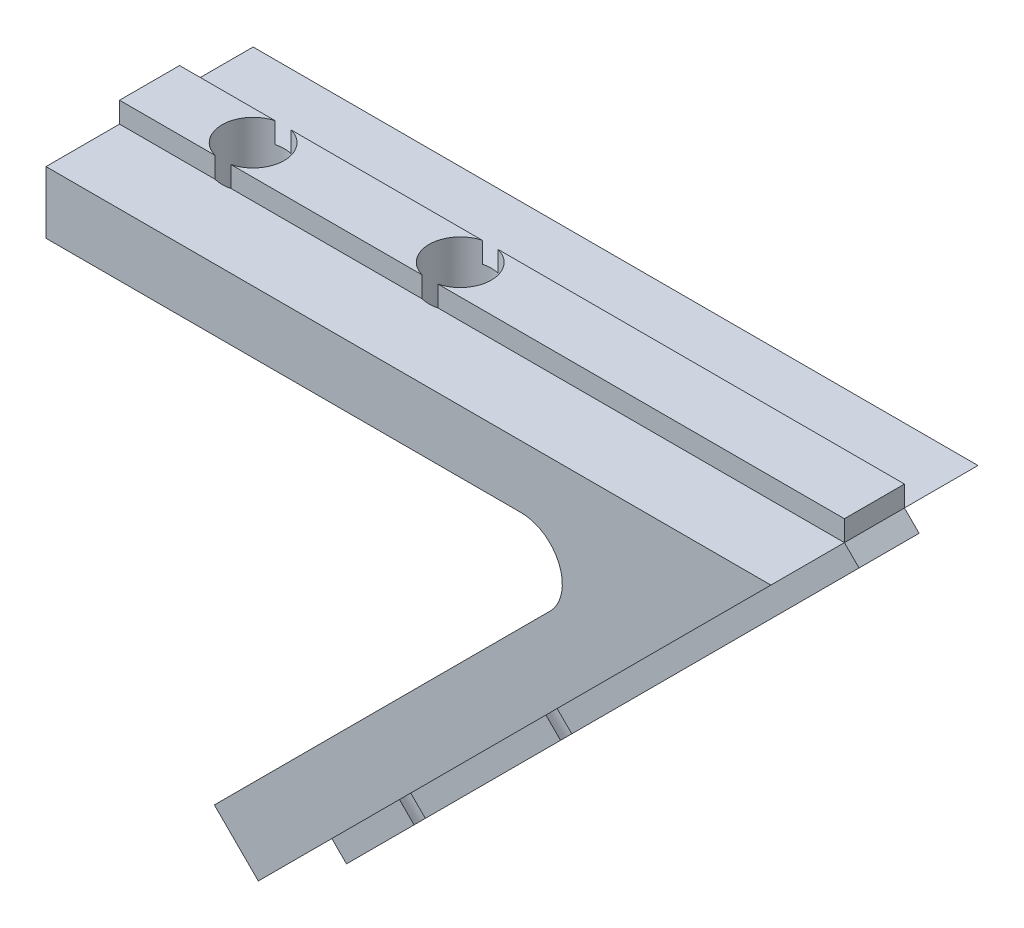
ISO-10303-21;
HEADER;
FILE_DESCRIPTION(('STEP AP214'),'2;1');
FILE_NAME('part.step','',(''),(''),'','','');
FILE_SCHEMA(('AUTOMOTIVE_DESIGN { 1 0 10303 214 1 1 1 1 }'));
ENDSEC;
DATA;
#1=APPLICATION_CONTEXT('core data for automotive mechanical design processes');
#2=APPLICATION_PROTOCOL_DEFINITION('international standard','automotive_design',2000,#1);
#3=PRODUCT_CONTEXT('',#1,'mechanical');
#4=PRODUCT('Part','Part','',(#3));
#5=PRODUCT_RELATED_PRODUCT_CATEGORY('part','',(#4));
#6=PRODUCT_DEFINITION_FORMATION('','',#4);
#7=PRODUCT_DEFINITION_CONTEXT('part definition',#1,'design');
#8=PRODUCT_DEFINITION('design','',#6,#7);
#9=PRODUCT_DEFINITION_SHAPE('','',#8);
#10=(LENGTH_UNIT() NAMED_UNIT(*) SI_UNIT(.MILLI.,.METRE.));
#11=(NAMED_UNIT(*) PLANE_ANGLE_UNIT() SI_UNIT($,.RADIAN.));
#12=(NAMED_UNIT(*) SI_UNIT($,.STERADIAN.) SOLID_ANGLE_UNIT());
#13=UNCERTAINTY_MEASURE_WITH_UNIT(LENGTH_MEASURE(1.E-05),#10,'distance_accuracy_value','');
#14=(GEOMETRIC_REPRESENTATION_CONTEXT(3) GLOBAL_UNCERTAINTY_ASSIGNED_CONTEXT((#13)) GLOBAL_UNIT_ASSIGNED_CONTEXT((#10,
#11,#12)) REPRESENTATION_CONTEXT('',''));
#15=CARTESIAN_POINT('',(0.,0.,0.));
#16=DIRECTION('',(0.,0.,1.));
#17=DIRECTION('',(1.,0.,0.));
#18=AXIS2_PLACEMENT_3D('',#15,#16,#17);
#19=CARTESIAN_POINT('',(10.9583694396573,-25.4558441227156,3.55));
#20=DIRECTION('',(0.,0.,1.));
#21=DIRECTION('',(1.,0.,0.));
#22=AXIS2_PLACEMENT_3D('',#19,#20,#21);
#23=PLANE('',#22);
#24=DIRECTION('',(0.707106781186551,0.707106781186544,0.));
#25=VECTOR('',#24,1.);
#26=CARTESIAN_POINT('',(10.9583694396573,-25.4558441227156,3.55));
#27=LINE('',#26,#25);
#28=CARTESIAN_POINT('',(21.8365406697355,-14.5776728926374,3.55));
#29=VERTEX_POINT('',#28);
#30=CARTESIAN_POINT('',(35.7071067811865,-0.707106781186558,3.55));
#31=VERTEX_POINT('',#30);
#32=EDGE_CURVE('E253',#29,#31,#27,.T.);
#33=ORIENTED_EDGE('',*,*,#32,.F.);
#34=DIRECTION('',(-0.707106781186544,0.707106781186551,0.));
#35=VECTOR('',#34,1.);
#36=CARTESIAN_POINT('',(34.2109093405001,-26.9520415634021,3.55));
#37=LINE('',#36,#35);
#38=CARTESIAN_POINT('',(21.129433888549,-13.8705661114509,3.55));
#39=VERTEX_POINT('',#38);
#40=EDGE_CURVE('E798',#29,#39,#37,.T.);
#41=ORIENTED_EDGE('',*,*,#40,.T.);
#42=DIRECTION('',(0.707106781186551,0.707106781186544,0.));
#43=VECTOR('',#42,1.);
#44=CARTESIAN_POINT('',(10.2512626584707,-24.748737341529,3.55));
#45=LINE('',#44,#43);
#46=CARTESIAN_POINT('',(35.,0.,3.55));
#47=VERTEX_POINT('',#46);
#48=EDGE_CURVE('E264',#39,#47,#45,.T.);
#49=ORIENTED_EDGE('',*,*,#48,.T.);
#50=DIRECTION('',(-0.707106781186544,0.707106781186551,0.));
#51=VECTOR('',#50,1.);
#52=CARTESIAN_POINT('',(35.7071067811865,-0.707106781186558,3.55));
#53=LINE('',#52,#51);
#54=EDGE_CURVE('E314',#31,#47,#53,.T.);
#55=ORIENTED_EDGE('',*,*,#54,.F.);
#56=EDGE_LOOP('',(#33,#41,#49,#55));
#57=FACE_BOUND('',#56,.T.);
#58=ADVANCED_FACE('F32',(#57),#23,.F.);
#59=CARTESIAN_POINT('',(18.2071067811864,-18.2071067811866,0.));
#60=DIRECTION('',(-0.707106781186544,0.707106781186551,0.));
#61=DIRECTION('',(-0.707106781186551,-0.707106781186544,0.));
#62=AXIS2_PLACEMENT_3D('',#59,#60,#61);
#63=PLANE('',#62);
#64=DIRECTION('',(-0.707106781186551,-0.707106781186544,0.));
#65=VECTOR('',#64,1.);
#66=CARTESIAN_POINT('',(10.9583694396573,-25.4558441227156,6.45));
#67=LINE('',#66,#65);
#68=CARTESIAN_POINT('',(35.7071067811865,-0.707106781186558,6.45000000000001));
#69=VERTEX_POINT('',#68);
#70=CARTESIAN_POINT('',(21.8365406697355,-14.5776728926374,6.45));
#71=VERTEX_POINT('',#70);
#72=EDGE_CURVE('E294',#69,#71,#67,.T.);
#73=ORIENTED_EDGE('',*,*,#72,.T.);
#74=CARTESIAN_POINT('',(21.5649711574555,-14.8492424049174,5.));
#75=DIRECTION('',(-0.707106781186544,0.707106781186551,0.));
#76=DIRECTION('',(-0.707106781186551,-0.707106781186544,0.));
#77=AXIS2_PLACEMENT_3D('',#74,#75,#76);
#78=CIRCLE('',#77,1.5);
#79=EDGE_CURVE('E47',#71,#29,#78,.T.);
#80=ORIENTED_EDGE('',*,*,#79,.T.);
#81=ORIENTED_EDGE('',*,*,#32,.T.);
#82=DIRECTION('',(0.,0.,1.));
#83=VECTOR('',#82,1.);
#84=CARTESIAN_POINT('',(35.7071067811865,-0.707106781186558,3.55));
#85=LINE('',#84,#83);
#86=EDGE_CURVE('E291',#31,#69,#85,.T.);
#87=ORIENTED_EDGE('',*,*,#86,.T.);
#88=EDGE_LOOP('',(#73,#80,#81,#87));
#89=FACE_BOUND('',#88,.T.);
#90=ADVANCED_FACE('F438',(#89),#63,.F.);
#91=CARTESIAN_POINT('',(10.9583694396573,-25.4558441227156,6.45));
#92=DIRECTION('',(0.,0.,-1.));
#93=DIRECTION('',(-1.,0.,0.));
#94=AXIS2_PLACEMENT_3D('',#91,#92,#93);
#95=PLANE('',#94);
#96=CARTESIAN_POINT('',(21.2934016451755,-15.1208119171974,6.45));
#97=VERTEX_POINT('',#96);
#98=CARTESIAN_POINT('',(14.76547285787,-21.6487407045029,6.45));
#99=VERTEX_POINT('',#98);
#100=EDGE_CURVE('E296',#97,#99,#67,.T.);
#101=ORIENTED_EDGE('',*,*,#100,.F.);
#102=DIRECTION('',(-0.707106781186544,0.707106781186551,0.));
#103=VECTOR('',#102,1.);
#104=CARTESIAN_POINT('',(33.66777031594,-27.4951805879621,6.45));
#105=LINE('',#104,#103);
#106=CARTESIAN_POINT('',(20.586294863989,-14.4137051360109,6.45));
#107=VERTEX_POINT('',#106);
#108=EDGE_CURVE('E11',#97,#107,#105,.T.);
#109=ORIENTED_EDGE('',*,*,#108,.T.);
#110=DIRECTION('',(-0.707106781186551,-0.707106781186544,0.));
#111=VECTOR('',#110,1.);
#112=CARTESIAN_POINT('',(10.2512626584707,-24.748737341529,6.45));
#113=LINE('',#112,#111);
#114=CARTESIAN_POINT('',(14.0583660766835,-20.9416339233163,6.45));
#115=VERTEX_POINT('',#114);
#116=EDGE_CURVE('E242',#107,#115,#113,.T.);
#117=ORIENTED_EDGE('',*,*,#116,.T.);
#118=DIRECTION('',(-0.707106781186544,0.707106781186551,0.));
#119=VECTOR('',#118,1.);
#120=CARTESIAN_POINT('',(27.1398415286345,-34.0231093752675,6.45));
#121=LINE('',#120,#119);
#122=EDGE_CURVE('E489',#115,#99,#121,.F.);
#123=ORIENTED_EDGE('',*,*,#122,.T.);
#124=EDGE_LOOP('',(#101,#109,#117,#123));
#125=FACE_BOUND('',#124,.T.);
#126=ADVANCED_FACE('F583',(#125),#95,.F.);
#127=CARTESIAN_POINT('',(14.0583660766835,-20.9416339233163,3.55));
#128=VERTEX_POINT('',#127);
#129=CARTESIAN_POINT('',(20.586294863989,-14.4137051360109,3.55));
#130=VERTEX_POINT('',#129);
#131=EDGE_CURVE('E263',#128,#130,#45,.T.);
#132=ORIENTED_EDGE('',*,*,#131,.T.);
#133=DIRECTION('',(-0.707106781186544,0.707106781186551,0.));
#134=VECTOR('',#133,1.);
#135=CARTESIAN_POINT('',(33.66777031594,-27.4951805879621,3.55));
#136=LINE('',#135,#134);
#137=CARTESIAN_POINT('',(21.2934016451755,-15.1208119171975,3.55));
#138=VERTEX_POINT('',#137);
#139=EDGE_CURVE('E436',#130,#138,#136,.F.);
#140=ORIENTED_EDGE('',*,*,#139,.T.);
#141=CARTESIAN_POINT('',(14.76547285787,-21.6487407045029,3.55));
#142=VERTEX_POINT('',#141);
#143=EDGE_CURVE('E292',#142,#138,#27,.T.);
#144=ORIENTED_EDGE('',*,*,#143,.F.);
#145=DIRECTION('',(-0.707106781186544,0.707106781186551,0.));
#146=VECTOR('',#145,1.);
#147=CARTESIAN_POINT('',(27.1398415286346,-34.0231093752675,3.55));
#148=LINE('',#147,#146);
#149=EDGE_CURVE('E434',#142,#128,#148,.T.);
#150=ORIENTED_EDGE('',*,*,#149,.T.);
#151=EDGE_LOOP('',(#132,#140,#144,#150));
#152=FACE_BOUND('',#151,.T.);
#153=ADVANCED_FACE('F433',(#152),#23,.F.);
#154=CARTESIAN_POINT('',(14.22233383331,-22.1918797290629,6.45));
#155=VERTEX_POINT('',#154);
#156=CARTESIAN_POINT('',(10.9583694396573,-25.4558441227156,6.45));
#157=VERTEX_POINT('',#156);
#158=EDGE_CURVE('E293',#155,#157,#67,.T.);
#159=ORIENTED_EDGE('',*,*,#158,.F.);
#160=DIRECTION('',(-0.707106781186544,0.707106781186551,0.));
#161=VECTOR('',#160,1.);
#162=CARTESIAN_POINT('',(26.5967025040745,-34.5662483998275,6.45));
#163=LINE('',#162,#161);
#164=CARTESIAN_POINT('',(13.5152270521235,-21.4847729478763,6.45));
#165=VERTEX_POINT('',#164);
#166=EDGE_CURVE('E55',#155,#165,#163,.T.);
#167=ORIENTED_EDGE('',*,*,#166,.T.);
#168=CARTESIAN_POINT('',(10.2512626584707,-24.748737341529,6.45));
#169=VERTEX_POINT('',#168);
#170=EDGE_CURVE('E251',#165,#169,#113,.T.);
#171=ORIENTED_EDGE('',*,*,#170,.T.);
#172=DIRECTION('',(-0.707106781186544,0.707106781186551,0.));
#173=VECTOR('',#172,1.);
#174=CARTESIAN_POINT('',(10.9583694396573,-25.4558441227156,6.45));
#175=LINE('',#174,#173);
#176=EDGE_CURVE('E295',#157,#169,#175,.T.);
#177=ORIENTED_EDGE('',*,*,#176,.F.);
#178=EDGE_LOOP('',(#159,#167,#171,#177));
#179=FACE_BOUND('',#178,.T.);
#180=ADVANCED_FACE('F304',(#179),#95,.F.);
#181=ORIENTED_EDGE('',*,*,#143,.T.);
#182=EDGE_CURVE('E799',#138,#97,#78,.T.);
#183=ORIENTED_EDGE('',*,*,#182,.T.);
#184=ORIENTED_EDGE('',*,*,#100,.T.);
#185=CARTESIAN_POINT('',(14.49390334559,-21.9203102167829,5.));
#186=DIRECTION('',(-0.707106781186544,0.707106781186551,0.));
#187=DIRECTION('',(-0.707106781186551,-0.707106781186544,0.));
#188=AXIS2_PLACEMENT_3D('',#185,#186,#187);
#189=CIRCLE('',#188,1.5);
#190=EDGE_CURVE('E233',#99,#142,#189,.T.);
#191=ORIENTED_EDGE('',*,*,#190,.T.);
#192=EDGE_LOOP('',(#181,#183,#184,#191));
#193=FACE_BOUND('',#192,.T.);
#194=ADVANCED_FACE('F425',(#193),#63,.F.);
#195=CARTESIAN_POINT('',(0.,1.,6.45000000000001));
#196=DIRECTION('',(0.,0.,-1.));
#197=DIRECTION('',(-1.,0.,0.));
#198=AXIS2_PLACEMENT_3D('',#195,#196,#197);
#199=PLANE('',#198);
#200=DIRECTION('',(1.,0.,0.));
#201=VECTOR('',#200,1.);
#202=CARTESIAN_POINT('',(0.,1.,6.45000000000001));
#203=LINE('',#202,#201);
#204=CARTESIAN_POINT('',(15.3840572873934,1.,6.45000000000001));
#205=VERTEX_POINT('',#204);
#206=CARTESIAN_POINT('',(35.,1.,6.45000000000001));
#207=VERTEX_POINT('',#206);
#208=EDGE_CURVE('E325',#205,#207,#203,.T.);
#209=ORIENTED_EDGE('',*,*,#208,.F.);
#210=DIRECTION('',(0.,-1.,0.));
#211=VECTOR('',#210,1.);
#212=CARTESIAN_POINT('',(15.3840572873934,1.,6.45000000000001));
#213=LINE('',#212,#211);
#214=CARTESIAN_POINT('',(15.3840572873934,0.,6.45000000000001));
#215=VERTEX_POINT('',#214);
#216=EDGE_CURVE('E461',#205,#215,#213,.T.);
#217=ORIENTED_EDGE('',*,*,#216,.T.);
#218=DIRECTION('',(1.,0.,0.));
#219=VECTOR('',#218,1.);
#220=CARTESIAN_POINT('',(0.,0.,6.45000000000001));
#221=LINE('',#220,#219);
#222=CARTESIAN_POINT('',(35.,0.,6.45000000000001));
#223=VERTEX_POINT('',#222);
#224=EDGE_CURVE('E313',#215,#223,#221,.T.);
#225=ORIENTED_EDGE('',*,*,#224,.T.);
#226=DIRECTION('',(0.,-1.,0.));
#227=VECTOR('',#226,1.);
#228=CARTESIAN_POINT('',(35.,1.,6.45000000000001));
#229=LINE('',#228,#227);
#230=EDGE_CURVE('E352',#207,#223,#229,.T.);
#231=ORIENTED_EDGE('',*,*,#230,.F.);
#232=EDGE_LOOP('',(#209,#217,#225,#231));
#233=FACE_BOUND('',#232,.T.);
#234=ADVANCED_FACE('F459',(#233),#199,.F.);
#235=CARTESIAN_POINT('',(0.,1.,0.));
#236=DIRECTION('',(0.,-1.,0.));
#237=DIRECTION('',(0.,0.,-1.));
#238=AXIS2_PLACEMENT_3D('',#235,#236,#237);
#239=PLANE('',#238);
#240=DIRECTION('',(-1.,0.,0.));
#241=VECTOR('',#240,1.);
#242=CARTESIAN_POINT('',(0.,1.,3.55000000000001));
#243=LINE('',#242,#241);
#244=CARTESIAN_POINT('',(35.,1.,3.54999999999999));
#245=VERTEX_POINT('',#244);
#246=CARTESIAN_POINT('',(15.3840572873934,1.,3.55));
#247=VERTEX_POINT('',#246);
#248=EDGE_CURVE('E334',#245,#247,#243,.T.);
#249=ORIENTED_EDGE('',*,*,#248,.T.);
#250=CARTESIAN_POINT('',(15.,1.,5.));
#251=DIRECTION('',(0.,-1.,0.));
#252=DIRECTION('',(0.,0.,-1.));
#253=AXIS2_PLACEMENT_3D('',#250,#251,#252);
#254=CIRCLE('',#253,1.5);
#255=EDGE_CURVE('E455',#247,#205,#254,.T.);
#256=ORIENTED_EDGE('',*,*,#255,.T.);
#257=ORIENTED_EDGE('',*,*,#208,.T.);
#258=DIRECTION('',(0.,0.,-1.));
#259=VECTOR('',#258,1.);
#260=CARTESIAN_POINT('',(35.,1.,6.45000000000001));
#261=LINE('',#260,#259);
#262=EDGE_CURVE('E330',#207,#245,#261,.T.);
#263=ORIENTED_EDGE('',*,*,#262,.T.);
#264=EDGE_LOOP('',(#249,#256,#257,#263));
#265=FACE_BOUND('',#264,.T.);
#266=ADVANCED_FACE('F454',(#265),#239,.F.);
#267=CARTESIAN_POINT('',(0.,1.,3.55000000000001));
#268=DIRECTION('',(0.,0.,1.));
#269=DIRECTION('',(1.,0.,0.));
#270=AXIS2_PLACEMENT_3D('',#267,#268,#269);
#271=PLANE('',#270);
#272=CARTESIAN_POINT('',(14.6159427126066,1.,3.55));
#273=VERTEX_POINT('',#272);
#274=CARTESIAN_POINT('',(5.38405728739345,1.,3.55000000000001));
#275=VERTEX_POINT('',#274);
#276=EDGE_CURVE('E337',#273,#275,#243,.T.);
#277=ORIENTED_EDGE('',*,*,#276,.F.);
#278=DIRECTION('',(0.,-1.,0.));
#279=VECTOR('',#278,1.);
#280=CARTESIAN_POINT('',(14.6159427126066,1.,3.55));
#281=LINE('',#280,#279);
#282=CARTESIAN_POINT('',(14.6159427126066,0.,3.55));
#283=VERTEX_POINT('',#282);
#284=EDGE_CURVE('E417',#273,#283,#281,.T.);
#285=ORIENTED_EDGE('',*,*,#284,.T.);
#286=DIRECTION('',(-1.,0.,0.));
#287=VECTOR('',#286,1.);
#288=CARTESIAN_POINT('',(0.,0.,3.55000000000001));
#289=LINE('',#288,#287);
#290=CARTESIAN_POINT('',(5.38405728739345,0.,3.55000000000001));
#291=VERTEX_POINT('',#290);
#292=EDGE_CURVE('E346',#283,#291,#289,.T.);
#293=ORIENTED_EDGE('',*,*,#292,.T.);
#294=DIRECTION('',(0.,-1.,0.));
#295=VECTOR('',#294,1.);
#296=CARTESIAN_POINT('',(5.38405728739345,1.,3.55000000000001));
#297=LINE('',#296,#295);
#298=EDGE_CURVE('E515',#291,#275,#297,.F.);
#299=ORIENTED_EDGE('',*,*,#298,.T.);
#300=EDGE_LOOP('',(#277,#285,#293,#299));
#301=FACE_BOUND('',#300,.T.);
#302=ADVANCED_FACE('F550',(#301),#271,.F.);
#303=CARTESIAN_POINT('',(5.38405728739341,0.,6.45000000000001));
#304=VERTEX_POINT('',#303);
#305=CARTESIAN_POINT('',(14.6159427126066,0.,6.45000000000001));
#306=VERTEX_POINT('',#305);
#307=EDGE_CURVE('E316',#304,#306,#221,.T.);
#308=ORIENTED_EDGE('',*,*,#307,.T.);
#309=DIRECTION('',(0.,-1.,0.));
#310=VECTOR('',#309,1.);
#311=CARTESIAN_POINT('',(14.6159427126066,1.,6.45000000000001));
#312=LINE('',#311,#310);
#313=CARTESIAN_POINT('',(14.6159427126066,1.,6.45000000000001));
#314=VERTEX_POINT('',#313);
#315=EDGE_CURVE('E507',#306,#314,#312,.F.);
#316=ORIENTED_EDGE('',*,*,#315,.T.);
#317=CARTESIAN_POINT('',(5.38405728739341,1.,6.45000000000001));
#318=VERTEX_POINT('',#317);
#319=EDGE_CURVE('E331',#318,#314,#203,.T.);
#320=ORIENTED_EDGE('',*,*,#319,.F.);
#321=DIRECTION('',(0.,-1.,0.));
#322=VECTOR('',#321,1.);
#323=CARTESIAN_POINT('',(5.38405728739341,1.,6.45000000000001));
#324=LINE('',#323,#322);
#325=EDGE_CURVE('E270',#318,#304,#324,.T.);
#326=ORIENTED_EDGE('',*,*,#325,.T.);
#327=EDGE_LOOP('',(#308,#316,#320,#326));
#328=FACE_BOUND('',#327,.T.);
#329=ADVANCED_FACE('F546',(#328),#199,.F.);
#330=CARTESIAN_POINT('',(4.61594271260655,1.,3.55000000000001));
#331=VERTEX_POINT('',#330);
#332=CARTESIAN_POINT('',(0.,1.,3.55000000000001));
#333=VERTEX_POINT('',#332);
#334=EDGE_CURVE('E333',#331,#333,#243,.T.);
#335=ORIENTED_EDGE('',*,*,#334,.F.);
#336=DIRECTION('',(0.,-1.,0.));
#337=VECTOR('',#336,1.);
#338=CARTESIAN_POINT('',(4.61594271260655,1.,3.55000000000001));
#339=LINE('',#338,#337);
#340=CARTESIAN_POINT('',(4.61594271260655,0.,3.55000000000001));
#341=VERTEX_POINT('',#340);
#342=EDGE_CURVE('E523',#331,#341,#339,.T.);
#343=ORIENTED_EDGE('',*,*,#342,.T.);
#344=CARTESIAN_POINT('',(0.,0.,3.55));
#345=VERTEX_POINT('',#344);
#346=EDGE_CURVE('E343',#341,#345,#289,.T.);
#347=ORIENTED_EDGE('',*,*,#346,.T.);
#348=DIRECTION('',(0.,-1.,0.));
#349=VECTOR('',#348,1.);
#350=CARTESIAN_POINT('',(0.,1.,3.55000000000001));
#351=LINE('',#350,#349);
#352=EDGE_CURVE('E336',#333,#345,#351,.T.);
#353=ORIENTED_EDGE('',*,*,#352,.F.);
#354=EDGE_LOOP('',(#335,#343,#347,#353));
#355=FACE_BOUND('',#354,.T.);
#356=ADVANCED_FACE('F557',(#355),#271,.F.);
#357=ORIENTED_EDGE('',*,*,#319,.T.);
#358=EDGE_CURVE('E501',#314,#273,#254,.T.);
#359=ORIENTED_EDGE('',*,*,#358,.T.);
#360=ORIENTED_EDGE('',*,*,#276,.T.);
#361=CARTESIAN_POINT('',(5.,1.,5.));
#362=DIRECTION('',(0.,-1.,0.));
#363=DIRECTION('',(0.,0.,-1.));
#364=AXIS2_PLACEMENT_3D('',#361,#362,#363);
#365=CIRCLE('',#364,1.5);
#366=EDGE_CURVE('E512',#275,#318,#365,.T.);
#367=ORIENTED_EDGE('',*,*,#366,.T.);
#368=EDGE_LOOP('',(#357,#359,#360,#367));
#369=FACE_BOUND('',#368,.T.);
#370=ADVANCED_FACE('F543',(#369),#239,.F.);
#371=CARTESIAN_POINT('',(35.,0.,10.));
#372=DIRECTION('',(-0.707106781186544,0.707106781186551,0.));
#373=DIRECTION('',(-0.707106781186551,-0.707106781186544,0.));
#374=AXIS2_PLACEMENT_3D('',#371,#372,#373);
#375=PLANE('',#374);
#376=ORIENTED_EDGE('',*,*,#48,.F.);
#377=CARTESIAN_POINT('',(20.857864376269,-14.1421356237309,5.));
#378=DIRECTION('',(-0.707106781186544,0.707106781186551,0.));
#379=DIRECTION('',(-0.707106781186551,-0.707106781186544,0.));
#380=AXIS2_PLACEMENT_3D('',#377,#378,#379);
#381=CIRCLE('',#380,1.5);
#382=EDGE_CURVE('E801',#39,#130,#381,.T.);
#383=ORIENTED_EDGE('',*,*,#382,.T.);
#384=ORIENTED_EDGE('',*,*,#131,.F.);
#385=CARTESIAN_POINT('',(13.7867965644035,-21.2132034355963,5.));
#386=DIRECTION('',(-0.707106781186544,0.707106781186551,0.));
#387=DIRECTION('',(-0.707106781186551,-0.707106781186544,0.));
#388=AXIS2_PLACEMENT_3D('',#385,#386,#387);
#389=CIRCLE('',#388,1.5);
#390=CARTESIAN_POINT('',(13.5152270521234,-21.4847729478763,3.55));
#391=VERTEX_POINT('',#390);
#392=EDGE_CURVE('E487',#128,#391,#389,.T.);
#393=ORIENTED_EDGE('',*,*,#392,.T.);
#394=CARTESIAN_POINT('',(10.2512626584707,-24.748737341529,3.55));
#395=VERTEX_POINT('',#394);
#396=EDGE_CURVE('E257',#395,#391,#45,.T.);
#397=ORIENTED_EDGE('',*,*,#396,.F.);
#398=DIRECTION('',(0.,0.,-1.));
#399=VECTOR('',#398,1.);
#400=CARTESIAN_POINT('',(10.2512626584707,-24.748737341529,10.));
#401=LINE('',#400,#399);
#402=CARTESIAN_POINT('',(10.2512626584707,-24.748737341529,0.));
#403=VERTEX_POINT('',#402);
#404=EDGE_CURVE('E312',#395,#403,#401,.T.);
#405=ORIENTED_EDGE('',*,*,#404,.T.);
#406=DIRECTION('',(0.707106781186551,0.707106781186544,0.));
#407=VECTOR('',#406,1.);
#408=CARTESIAN_POINT('',(35.,0.,0.));
#409=LINE('',#408,#407);
#410=CARTESIAN_POINT('',(35.,0.,0.));
#411=VERTEX_POINT('',#410);
#412=EDGE_CURVE('E386',#403,#411,#409,.T.);
#413=ORIENTED_EDGE('',*,*,#412,.T.);
#414=DIRECTION('',(0.,0.,-1.));
#415=VECTOR('',#414,1.);
#416=CARTESIAN_POINT('',(35.,0.,10.));
#417=LINE('',#416,#415);
#418=EDGE_CURVE('E394',#47,#411,#417,.T.);
#419=ORIENTED_EDGE('',*,*,#418,.F.);
#420=EDGE_LOOP('',(#376,#383,#384,#393,#397,#405,#413,#419));
#421=FACE_BOUND('',#420,.T.);
#422=ADVANCED_FACE('F485',(#421),#375,.F.);
#423=ORIENTED_EDGE('',*,*,#116,.F.);
#424=CARTESIAN_POINT('',(20.857864376269,-14.1421356237309,5.));
#425=DIRECTION('',(-0.707106781186544,0.707106781186551,0.));
#426=DIRECTION('',(-0.707106781186551,-0.707106781186544,0.));
#427=AXIS2_PLACEMENT_3D('',#424,#425,#426);
#428=CIRCLE('',#427,1.5);
#429=CARTESIAN_POINT('',(21.129433888549,-13.8705661114509,6.45));
#430=VERTEX_POINT('',#429);
#431=EDGE_CURVE('E228',#107,#430,#428,.T.);
#432=ORIENTED_EDGE('',*,*,#431,.T.);
#433=EDGE_CURVE('E239',#223,#430,#113,.T.);
#434=ORIENTED_EDGE('',*,*,#433,.F.);
#435=CARTESIAN_POINT('',(35.,0.,10.));
#436=VERTEX_POINT('',#435);
#437=EDGE_CURVE('E395',#436,#223,#417,.T.);
#438=ORIENTED_EDGE('',*,*,#437,.F.);
#439=DIRECTION('',(0.707106781186551,0.707106781186544,0.));
#440=VECTOR('',#439,1.);
#441=CARTESIAN_POINT('',(35.,0.,10.));
#442=LINE('',#441,#440);
#443=CARTESIAN_POINT('',(10.2512626584707,-24.748737341529,10.));
#444=VERTEX_POINT('',#443);
#445=EDGE_CURVE('E371',#444,#436,#442,.T.);
#446=ORIENTED_EDGE('',*,*,#445,.F.);
#447=EDGE_CURVE('E397',#444,#169,#401,.T.);
#448=ORIENTED_EDGE('',*,*,#447,.T.);
#449=ORIENTED_EDGE('',*,*,#170,.F.);
#450=CARTESIAN_POINT('',(13.7867965644035,-21.2132034355963,5.));
#451=DIRECTION('',(-0.707106781186544,0.707106781186551,0.));
#452=DIRECTION('',(-0.707106781186551,-0.707106781186544,0.));
#453=AXIS2_PLACEMENT_3D('',#450,#451,#452);
#454=CIRCLE('',#453,1.5);
#455=EDGE_CURVE('E490',#165,#115,#454,.T.);
#456=ORIENTED_EDGE('',*,*,#455,.T.);
#457=EDGE_LOOP('',(#423,#432,#434,#438,#446,#448,#449,#456));
#458=FACE_BOUND('',#457,.T.);
#459=ADVANCED_FACE('F237',(#458),#375,.F.);
#460=CARTESIAN_POINT('',(0.,0.,10.));
#461=DIRECTION('',(0.,-1.,0.));
#462=DIRECTION('',(0.,0.,-1.));
#463=AXIS2_PLACEMENT_3D('',#460,#461,#462);
#464=PLANE('',#463);
#465=ORIENTED_EDGE('',*,*,#292,.F.);
#466=CARTESIAN_POINT('',(15.,0.,5.));
#467=DIRECTION('',(0.,-1.,0.));
#468=DIRECTION('',(0.,0.,-1.));
#469=AXIS2_PLACEMENT_3D('',#466,#467,#468);
#470=CIRCLE('',#469,1.5);
#471=CARTESIAN_POINT('',(15.3840572873934,0.,3.55));
#472=VERTEX_POINT('',#471);
#473=EDGE_CURVE('E500',#283,#472,#470,.T.);
#474=ORIENTED_EDGE('',*,*,#473,.T.);
#475=EDGE_CURVE('E326',#47,#472,#289,.T.);
#476=ORIENTED_EDGE('',*,*,#475,.F.);
#477=ORIENTED_EDGE('',*,*,#418,.T.);
#478=DIRECTION('',(-1.,0.,0.));
#479=VECTOR('',#478,1.);
#480=CARTESIAN_POINT('',(0.,0.,0.));
#481=LINE('',#480,#479);
#482=CARTESIAN_POINT('',(0.,0.,0.));
#483=VERTEX_POINT('',#482);
#484=EDGE_CURVE('E363',#411,#483,#481,.T.);
#485=ORIENTED_EDGE('',*,*,#484,.T.);
#486=DIRECTION('',(0.,0.,-1.));
#487=VECTOR('',#486,1.);
#488=CARTESIAN_POINT('',(0.,0.,10.));
#489=LINE('',#488,#487);
#490=EDGE_CURVE('E375',#345,#483,#489,.T.);
#491=ORIENTED_EDGE('',*,*,#490,.F.);
#492=ORIENTED_EDGE('',*,*,#346,.F.);
#493=CARTESIAN_POINT('',(5.,0.,5.));
#494=DIRECTION('',(0.,-1.,0.));
#495=DIRECTION('',(0.,0.,-1.));
#496=AXIS2_PLACEMENT_3D('',#493,#494,#495);
#497=CIRCLE('',#496,1.5);
#498=EDGE_CURVE('E520',#341,#291,#497,.T.);
#499=ORIENTED_EDGE('',*,*,#498,.T.);
#500=EDGE_LOOP('',(#465,#474,#476,#477,#485,#491,#492,#499));
#501=FACE_BOUND('',#500,.T.);
#502=ADVANCED_FACE('F554',(#501),#464,.F.);
#503=ORIENTED_EDGE('',*,*,#224,.F.);
#504=CARTESIAN_POINT('',(15.,0.,5.));
#505=DIRECTION('',(0.,-1.,0.));
#506=DIRECTION('',(0.,0.,-1.));
#507=AXIS2_PLACEMENT_3D('',#504,#505,#506);
#508=CIRCLE('',#507,1.5);
#509=EDGE_CURVE('E465',#215,#306,#508,.T.);
#510=ORIENTED_EDGE('',*,*,#509,.T.);
#511=ORIENTED_EDGE('',*,*,#307,.F.);
#512=CARTESIAN_POINT('',(5.,0.,5.));
#513=DIRECTION('',(0.,-1.,0.));
#514=DIRECTION('',(0.,0.,-1.));
#515=AXIS2_PLACEMENT_3D('',#512,#513,#514);
#516=CIRCLE('',#515,1.5);
#517=CARTESIAN_POINT('',(4.61594271260659,0.,6.45000000000001));
#518=VERTEX_POINT('',#517);
#519=EDGE_CURVE('E277',#304,#518,#516,.T.);
#520=ORIENTED_EDGE('',*,*,#519,.T.);
#521=CARTESIAN_POINT('',(0.,0.,6.45000000000001));
#522=VERTEX_POINT('',#521);
#523=EDGE_CURVE('E318',#522,#518,#221,.T.);
#524=ORIENTED_EDGE('',*,*,#523,.F.);
#525=CARTESIAN_POINT('',(0.,0.,10.));
#526=VERTEX_POINT('',#525);
#527=EDGE_CURVE('E391',#526,#522,#489,.T.);
#528=ORIENTED_EDGE('',*,*,#527,.F.);
#529=DIRECTION('',(-1.,0.,0.));
#530=VECTOR('',#529,1.);
#531=CARTESIAN_POINT('',(0.,0.,10.));
#532=LINE('',#531,#530);
#533=EDGE_CURVE('E373',#436,#526,#532,.T.);
#534=ORIENTED_EDGE('',*,*,#533,.F.);
#535=ORIENTED_EDGE('',*,*,#437,.T.);
#536=EDGE_LOOP('',(#503,#510,#511,#520,#524,#528,#534,#535));
#537=FACE_BOUND('',#536,.T.);
#538=ADVANCED_FACE('F464',(#537),#464,.F.);
#539=CARTESIAN_POINT('',(0.,0.,10.));
#540=DIRECTION('',(1.,0.,0.));
#541=DIRECTION('',(0.,1.,0.));
#542=AXIS2_PLACEMENT_3D('',#539,#540,#541);
#543=PLANE('',#542);
#544=DIRECTION('',(0.,-1.,0.));
#545=VECTOR('',#544,1.);
#546=CARTESIAN_POINT('',(0.,0.,0.));
#547=LINE('',#546,#545);
#548=CARTESIAN_POINT('',(0.,-3.,0.));
#549=VERTEX_POINT('',#548);
#550=EDGE_CURVE('E358',#483,#549,#547,.T.);
#551=ORIENTED_EDGE('',*,*,#550,.T.);
#552=DIRECTION('',(0.,0.,-1.));
#553=VECTOR('',#552,1.);
#554=CARTESIAN_POINT('',(0.,-3.,10.));
#555=LINE('',#554,#553);
#556=CARTESIAN_POINT('',(0.,-3.,10.));
#557=VERTEX_POINT('',#556);
#558=EDGE_CURVE('E408',#557,#549,#555,.T.);
#559=ORIENTED_EDGE('',*,*,#558,.F.);
#560=DIRECTION('',(0.,-1.,0.));
#561=VECTOR('',#560,1.);
#562=CARTESIAN_POINT('',(0.,0.,10.));
#563=LINE('',#562,#561);
#564=EDGE_CURVE('E359',#526,#557,#563,.T.);
#565=ORIENTED_EDGE('',*,*,#564,.F.);
#566=ORIENTED_EDGE('',*,*,#527,.T.);
#567=DIRECTION('',(0.,-1.,0.));
#568=VECTOR('',#567,1.);
#569=CARTESIAN_POINT('',(0.,1.,6.45000000000001));
#570=LINE('',#569,#568);
#571=CARTESIAN_POINT('',(0.,1.,6.45000000000001));
#572=VERTEX_POINT('',#571);
#573=EDGE_CURVE('E355',#572,#522,#570,.T.);
#574=ORIENTED_EDGE('',*,*,#573,.F.);
#575=DIRECTION('',(0.,0.,1.));
#576=VECTOR('',#575,1.);
#577=CARTESIAN_POINT('',(0.,1.,6.45000000000001));
#578=LINE('',#577,#576);
#579=EDGE_CURVE('E322',#333,#572,#578,.T.);
#580=ORIENTED_EDGE('',*,*,#579,.F.);
#581=ORIENTED_EDGE('',*,*,#352,.T.);
#582=ORIENTED_EDGE('',*,*,#490,.T.);
#583=EDGE_LOOP('',(#551,#559,#565,#566,#574,#580,#581,#582));
#584=FACE_BOUND('',#583,.T.);
#585=ADVANCED_FACE('F34',(#584),#543,.F.);
#586=CARTESIAN_POINT('',(0.,-3.,10.));
#587=DIRECTION('',(0.,1.,0.));
#588=DIRECTION('',(-1.,0.,0.));
#589=AXIS2_PLACEMENT_3D('',#586,#587,#588);
#590=PLANE('',#589);
#591=CARTESIAN_POINT('',(15.,-3.,5.));
#592=DIRECTION('',(0.,-1.,0.));
#593=DIRECTION('',(0.,0.,-1.));
#594=AXIS2_PLACEMENT_3D('',#591,#592,#593);
#595=CIRCLE('',#594,1.5);
#596=CARTESIAN_POINT('',(15.,-3.,3.5));
#597=VERTEX_POINT('',#596);
#598=EDGE_CURVE('E498',#597,#597,#595,.T.);
#599=ORIENTED_EDGE('',*,*,#598,.F.);
#600=EDGE_LOOP('',(#599));
#601=FACE_BOUND('',#600,.T.);
#602=CARTESIAN_POINT('',(5.,-3.,5.));
#603=DIRECTION('',(0.,-1.,0.));
#604=DIRECTION('',(0.,0.,-1.));
#605=AXIS2_PLACEMENT_3D('',#602,#603,#604);
#606=CIRCLE('',#605,1.5);
#607=CARTESIAN_POINT('',(5.,-3.,3.5));
#608=VERTEX_POINT('',#607);
#609=EDGE_CURVE('E511',#608,#608,#606,.T.);
#610=ORIENTED_EDGE('',*,*,#609,.F.);
#611=EDGE_LOOP('',(#610));
#612=FACE_BOUND('',#611,.T.);
#613=DIRECTION('',(1.,0.,0.));
#614=VECTOR('',#613,1.);
#615=CARTESIAN_POINT('',(0.,-3.,0.));
#616=LINE('',#615,#614);
#617=CARTESIAN_POINT('',(22.9289321881344,-3.,0.));
#618=VERTEX_POINT('',#617);
#619=EDGE_CURVE('E378',#549,#618,#616,.T.);
#620=ORIENTED_EDGE('',*,*,#619,.T.);
#621=DIRECTION('',(0.,0.,-1.));
#622=VECTOR('',#621,1.);
#623=CARTESIAN_POINT('',(22.9289321881344,-3.,10.));
#624=LINE('',#623,#622);
#625=CARTESIAN_POINT('',(22.9289321881344,-3.,10.));
#626=VERTEX_POINT('',#625);
#627=EDGE_CURVE('E405',#626,#618,#624,.T.);
#628=ORIENTED_EDGE('',*,*,#627,.F.);
#629=DIRECTION('',(1.,0.,0.));
#630=VECTOR('',#629,1.);
#631=CARTESIAN_POINT('',(0.,-3.,10.));
#632=LINE('',#631,#630);
#633=EDGE_CURVE('E362',#557,#626,#632,.T.);
#634=ORIENTED_EDGE('',*,*,#633,.F.);
#635=ORIENTED_EDGE('',*,*,#558,.T.);
#636=EDGE_LOOP('',(#620,#628,#634,#635));
#637=FACE_BOUND('',#636,.T.);
#638=ADVANCED_FACE('F560',(#601,#612,#637),#590,.F.);
#639=CARTESIAN_POINT('',(22.9289321881344,-5.,10.));
#640=DIRECTION('',(0.,0.,-1.));
#641=DIRECTION('',(-1.,0.,0.));
#642=AXIS2_PLACEMENT_3D('',#639,#640,#641);
#643=CYLINDRICAL_SURFACE('',#642,2.);
#644=CARTESIAN_POINT('',(22.9289321881344,-5.,0.));
#645=DIRECTION('',(0.,0.,-1.));
#646=DIRECTION('',(1.,0.,0.));
#647=AXIS2_PLACEMENT_3D('',#644,#645,#646);
#648=CIRCLE('',#647,2.);
#649=CARTESIAN_POINT('',(24.3431457505075,-6.4142135623731,0.));
#650=VERTEX_POINT('',#649);
#651=EDGE_CURVE('E380',#618,#650,#648,.T.);
#652=ORIENTED_EDGE('',*,*,#651,.T.);
#653=DIRECTION('',(0.,0.,-1.));
#654=VECTOR('',#653,1.);
#655=CARTESIAN_POINT('',(24.3431457505075,-6.4142135623731,10.));
#656=LINE('',#655,#654);
#657=CARTESIAN_POINT('',(24.3431457505075,-6.4142135623731,10.));
#658=VERTEX_POINT('',#657);
#659=EDGE_CURVE('E402',#658,#650,#656,.T.);
#660=ORIENTED_EDGE('',*,*,#659,.F.);
#661=CARTESIAN_POINT('',(22.9289321881344,-5.,10.));
#662=DIRECTION('',(0.,0.,-1.));
#663=DIRECTION('',(1.,0.,0.));
#664=AXIS2_PLACEMENT_3D('',#661,#662,#663);
#665=CIRCLE('',#664,2.);
#666=EDGE_CURVE('E365',#626,#658,#665,.T.);
#667=ORIENTED_EDGE('',*,*,#666,.F.);
#668=ORIENTED_EDGE('',*,*,#627,.T.);
#669=EDGE_LOOP('',(#652,#660,#667,#668));
#670=FACE_BOUND('',#669,.T.);
#671=ADVANCED_FACE('F564',(#670),#643,.F.);
#672=CARTESIAN_POINT('',(8.12994231491108,-22.6274169979694,10.));
#673=DIRECTION('',(0.707106781186544,-0.707106781186551,0.));
#674=DIRECTION('',(0.707106781186551,0.707106781186544,0.));
#675=AXIS2_PLACEMENT_3D('',#672,#673,#674);
#676=PLANE('',#675);
#677=CARTESIAN_POINT('',(18.7365440327094,-12.0208152801712,5.));
#678=DIRECTION('',(-0.707106781186544,0.707106781186551,0.));
#679=DIRECTION('',(-0.707106781186551,-0.707106781186544,0.));
#680=AXIS2_PLACEMENT_3D('',#677,#678,#679);
#681=CIRCLE('',#680,1.5);
#682=CARTESIAN_POINT('',(17.6758838609295,-13.081475451951,5.));
#683=VERTEX_POINT('',#682);
#684=EDGE_CURVE('E243',#683,#683,#681,.T.);
#685=ORIENTED_EDGE('',*,*,#684,.F.);
#686=EDGE_LOOP('',(#685));
#687=FACE_BOUND('',#686,.T.);
#688=CARTESIAN_POINT('',(11.6654762208438,-19.0918830920367,5.));
#689=DIRECTION('',(-0.707106781186544,0.707106781186551,0.));
#690=DIRECTION('',(-0.707106781186551,-0.707106781186544,0.));
#691=AXIS2_PLACEMENT_3D('',#688,#689,#690);
#692=CIRCLE('',#691,1.5);
#693=CARTESIAN_POINT('',(10.604816049064,-20.1525432638165,5.));
#694=VERTEX_POINT('',#693);
#695=EDGE_CURVE('E804',#694,#694,#692,.T.);
#696=ORIENTED_EDGE('',*,*,#695,.F.);
#697=EDGE_LOOP('',(#696));
#698=FACE_BOUND('',#697,.T.);
#699=DIRECTION('',(-0.707106781186551,-0.707106781186544,0.));
#700=VECTOR('',#699,1.);
#701=CARTESIAN_POINT('',(8.12994231491108,-22.6274169979694,0.));
#702=LINE('',#701,#700);
#703=CARTESIAN_POINT('',(8.12994231491108,-22.6274169979694,0.));
#704=VERTEX_POINT('',#703);
#705=EDGE_CURVE('E382',#650,#704,#702,.T.);
#706=ORIENTED_EDGE('',*,*,#705,.T.);
#707=DIRECTION('',(0.,0.,-1.));
#708=VECTOR('',#707,1.);
#709=CARTESIAN_POINT('',(8.12994231491108,-22.6274169979694,10.));
#710=LINE('',#709,#708);
#711=CARTESIAN_POINT('',(8.12994231491108,-22.6274169979694,10.));
#712=VERTEX_POINT('',#711);
#713=EDGE_CURVE('E399',#712,#704,#710,.T.);
#714=ORIENTED_EDGE('',*,*,#713,.F.);
#715=DIRECTION('',(-0.707106781186551,-0.707106781186544,0.));
#716=VECTOR('',#715,1.);
#717=CARTESIAN_POINT('',(8.12994231491108,-22.6274169979694,10.));
#718=LINE('',#717,#716);
#719=EDGE_CURVE('E367',#658,#712,#718,.T.);
#720=ORIENTED_EDGE('',*,*,#719,.F.);
#721=ORIENTED_EDGE('',*,*,#659,.T.);
#722=EDGE_LOOP('',(#706,#714,#720,#721));
#723=FACE_BOUND('',#722,.T.);
#724=ADVANCED_FACE('F565',(#687,#698,#723),#676,.F.);
#725=CARTESIAN_POINT('',(10.2512626584707,-24.748737341529,10.));
#726=DIRECTION('',(0.707106781186551,0.707106781186544,0.));
#727=DIRECTION('',(-0.707106781186544,0.707106781186551,0.));
#728=AXIS2_PLACEMENT_3D('',#725,#726,#727);
#729=PLANE('',#728);
#730=DIRECTION('',(0.707106781186544,-0.707106781186551,0.));
#731=VECTOR('',#730,1.);
#732=CARTESIAN_POINT('',(10.2512626584707,-24.748737341529,0.));
#733=LINE('',#732,#731);
#734=EDGE_CURVE('E384',#704,#403,#733,.T.);
#735=ORIENTED_EDGE('',*,*,#734,.T.);
#736=ORIENTED_EDGE('',*,*,#404,.F.);
#737=DIRECTION('',(-0.707106781186544,0.707106781186551,0.));
#738=VECTOR('',#737,1.);
#739=CARTESIAN_POINT('',(10.9583694396573,-25.4558441227156,3.55));
#740=LINE('',#739,#738);
#741=CARTESIAN_POINT('',(10.9583694396573,-25.4558441227156,3.55));
#742=VERTEX_POINT('',#741);
#743=EDGE_CURVE('E311',#742,#395,#740,.T.);
#744=ORIENTED_EDGE('',*,*,#743,.F.);
#745=DIRECTION('',(0.,0.,-1.));
#746=VECTOR('',#745,1.);
#747=CARTESIAN_POINT('',(10.9583694396573,-25.4558441227156,3.55));
#748=LINE('',#747,#746);
#749=EDGE_CURVE('E249',#157,#742,#748,.T.);
#750=ORIENTED_EDGE('',*,*,#749,.F.);
#751=ORIENTED_EDGE('',*,*,#176,.T.);
#752=ORIENTED_EDGE('',*,*,#447,.F.);
#753=DIRECTION('',(0.707106781186544,-0.707106781186551,0.));
#754=VECTOR('',#753,1.);
#755=CARTESIAN_POINT('',(10.2512626584707,-24.748737341529,10.));
#756=LINE('',#755,#754);
#757=EDGE_CURVE('E369',#712,#444,#756,.T.);
#758=ORIENTED_EDGE('',*,*,#757,.F.);
#759=ORIENTED_EDGE('',*,*,#713,.T.);
#760=EDGE_LOOP('',(#735,#736,#744,#750,#751,#752,#758,#759));
#761=FACE_BOUND('',#760,.T.);
#762=ADVANCED_FACE('F309',(#761),#729,.F.);
#763=CARTESIAN_POINT('',(22.9289321881344,-5.,10.));
#764=DIRECTION('',(0.,0.,1.));
#765=DIRECTION('',(1.,0.,0.));
#766=AXIS2_PLACEMENT_3D('',#763,#764,#765);
#767=PLANE('',#766);
#768=ORIENTED_EDGE('',*,*,#564,.T.);
#769=ORIENTED_EDGE('',*,*,#633,.T.);
#770=ORIENTED_EDGE('',*,*,#666,.T.);
#771=ORIENTED_EDGE('',*,*,#719,.T.);
#772=ORIENTED_EDGE('',*,*,#757,.T.);
#773=ORIENTED_EDGE('',*,*,#445,.T.);
#774=ORIENTED_EDGE('',*,*,#533,.T.);
#775=EDGE_LOOP('',(#768,#769,#770,#771,#772,#773,#774));
#776=FACE_BOUND('',#775,.T.);
#777=ADVANCED_FACE('F470',(#776),#767,.T.);
#778=CARTESIAN_POINT('',(22.9289321881344,-5.,0.));
#779=DIRECTION('',(0.,0.,1.));
#780=DIRECTION('',(1.,0.,0.));
#781=AXIS2_PLACEMENT_3D('',#778,#779,#780);
#782=PLANE('',#781);
#783=ORIENTED_EDGE('',*,*,#550,.F.);
#784=ORIENTED_EDGE('',*,*,#484,.F.);
#785=ORIENTED_EDGE('',*,*,#412,.F.);
#786=ORIENTED_EDGE('',*,*,#734,.F.);
#787=ORIENTED_EDGE('',*,*,#705,.F.);
#788=ORIENTED_EDGE('',*,*,#651,.F.);
#789=ORIENTED_EDGE('',*,*,#619,.F.);
#790=EDGE_LOOP('',(#783,#784,#785,#786,#787,#788,#789));
#791=FACE_BOUND('',#790,.T.);
#792=ADVANCED_FACE('F480',(#791),#782,.F.);
#793=ORIENTED_EDGE('',*,*,#523,.T.);
#794=DIRECTION('',(0.,-1.,0.));
#795=VECTOR('',#794,1.);
#796=CARTESIAN_POINT('',(4.61594271260659,1.,6.45000000000001));
#797=LINE('',#796,#795);
#798=CARTESIAN_POINT('',(4.61594271260659,1.,6.45000000000001));
#799=VERTEX_POINT('',#798);
#800=EDGE_CURVE('E284',#518,#799,#797,.F.);
#801=ORIENTED_EDGE('',*,*,#800,.T.);
#802=EDGE_CURVE('E327',#572,#799,#203,.T.);
#803=ORIENTED_EDGE('',*,*,#802,.F.);
#804=ORIENTED_EDGE('',*,*,#573,.T.);
#805=EDGE_LOOP('',(#793,#801,#803,#804));
#806=FACE_BOUND('',#805,.T.);
#807=ADVANCED_FACE('F527',(#806),#199,.F.);
#808=CARTESIAN_POINT('',(35.,1.,6.45000000000001));
#809=DIRECTION('',(-1.,0.,0.));
#810=DIRECTION('',(0.,0.,1.));
#811=AXIS2_PLACEMENT_3D('',#808,#809,#810);
#812=PLANE('',#811);
#813=DIRECTION('',(0.,0.,-1.));
#814=VECTOR('',#813,1.);
#815=CARTESIAN_POINT('',(35.,0.,6.45000000000001));
#816=LINE('',#815,#814);
#817=EDGE_CURVE('E340',#223,#47,#816,.T.);
#818=ORIENTED_EDGE('',*,*,#817,.T.);
#819=DIRECTION('',(0.,-1.,0.));
#820=VECTOR('',#819,1.);
#821=CARTESIAN_POINT('',(35.,1.,3.54999999999999));
#822=LINE('',#821,#820);
#823=EDGE_CURVE('E349',#245,#47,#822,.T.);
#824=ORIENTED_EDGE('',*,*,#823,.F.);
#825=ORIENTED_EDGE('',*,*,#262,.F.);
#826=ORIENTED_EDGE('',*,*,#230,.T.);
#827=EDGE_LOOP('',(#818,#824,#825,#826));
#828=FACE_BOUND('',#827,.T.);
#829=ADVANCED_FACE('F446',(#828),#812,.F.);
#830=ORIENTED_EDGE('',*,*,#475,.T.);
#831=DIRECTION('',(0.,-1.,0.));
#832=VECTOR('',#831,1.);
#833=CARTESIAN_POINT('',(15.3840572873934,1.,3.55));
#834=LINE('',#833,#832);
#835=EDGE_CURVE('E414',#472,#247,#834,.F.);
#836=ORIENTED_EDGE('',*,*,#835,.T.);
#837=ORIENTED_EDGE('',*,*,#248,.F.);
#838=ORIENTED_EDGE('',*,*,#823,.T.);
#839=EDGE_LOOP('',(#830,#836,#837,#838));
#840=FACE_BOUND('',#839,.T.);
#841=ADVANCED_FACE('F451',(#840),#271,.F.);
#842=ORIENTED_EDGE('',*,*,#802,.T.);
#843=CARTESIAN_POINT('',(5.,1.,5.));
#844=DIRECTION('',(0.,-1.,0.));
#845=DIRECTION('',(0.,0.,-1.));
#846=AXIS2_PLACEMENT_3D('',#843,#844,#845);
#847=CIRCLE('',#846,1.5);
#848=EDGE_CURVE('E411',#799,#331,#847,.T.);
#849=ORIENTED_EDGE('',*,*,#848,.T.);
#850=ORIENTED_EDGE('',*,*,#334,.T.);
#851=ORIENTED_EDGE('',*,*,#579,.T.);
#852=EDGE_LOOP('',(#842,#849,#850,#851));
#853=FACE_BOUND('',#852,.T.);
#854=ADVANCED_FACE('F530',(#853),#239,.F.);
#855=ORIENTED_EDGE('',*,*,#396,.T.);
#856=DIRECTION('',(-0.707106781186544,0.707106781186551,0.));
#857=VECTOR('',#856,1.);
#858=CARTESIAN_POINT('',(26.5967025040745,-34.5662483998275,3.55));
#859=LINE('',#858,#857);
#860=CARTESIAN_POINT('',(14.22233383331,-22.1918797290629,3.55));
#861=VERTEX_POINT('',#860);
#862=EDGE_CURVE('E493',#391,#861,#859,.F.);
#863=ORIENTED_EDGE('',*,*,#862,.T.);
#864=EDGE_CURVE('E288',#742,#861,#27,.T.);
#865=ORIENTED_EDGE('',*,*,#864,.F.);
#866=ORIENTED_EDGE('',*,*,#743,.T.);
#867=EDGE_LOOP('',(#855,#863,#865,#866));
#868=FACE_BOUND('',#867,.T.);
#869=ADVANCED_FACE('F579',(#868),#23,.F.);
#870=CARTESIAN_POINT('',(35.7071067811865,-0.707106781186558,3.55));
#871=DIRECTION('',(-0.707106781186551,-0.707106781186544,0.));
#872=DIRECTION('',(0.707106781186544,-0.707106781186551,0.));
#873=AXIS2_PLACEMENT_3D('',#870,#871,#872);
#874=PLANE('',#873);
#875=ORIENTED_EDGE('',*,*,#817,.F.);
#876=DIRECTION('',(-0.707106781186544,0.707106781186551,0.));
#877=VECTOR('',#876,1.);
#878=CARTESIAN_POINT('',(35.7071067811865,-0.707106781186558,6.45000000000001));
#879=LINE('',#878,#877);
#880=EDGE_CURVE('E248',#69,#223,#879,.T.);
#881=ORIENTED_EDGE('',*,*,#880,.F.);
#882=ORIENTED_EDGE('',*,*,#86,.F.);
#883=ORIENTED_EDGE('',*,*,#54,.T.);
#884=EDGE_LOOP('',(#875,#881,#882,#883));
#885=FACE_BOUND('',#884,.T.);
#886=ADVANCED_FACE('F443',(#885),#874,.F.);
#887=ORIENTED_EDGE('',*,*,#433,.T.);
#888=DIRECTION('',(-0.707106781186544,0.707106781186551,0.));
#889=VECTOR('',#888,1.);
#890=CARTESIAN_POINT('',(34.2109093405001,-26.9520415634021,6.45));
#891=LINE('',#890,#889);
#892=EDGE_CURVE('E40',#430,#71,#891,.F.);
#893=ORIENTED_EDGE('',*,*,#892,.T.);
#894=ORIENTED_EDGE('',*,*,#72,.F.);
#895=ORIENTED_EDGE('',*,*,#880,.T.);
#896=EDGE_LOOP('',(#887,#893,#894,#895));
#897=FACE_BOUND('',#896,.T.);
#898=ADVANCED_FACE('F246',(#897),#95,.F.);
#899=ORIENTED_EDGE('',*,*,#864,.T.);
#900=EDGE_CURVE('E303',#861,#155,#189,.T.);
#901=ORIENTED_EDGE('',*,*,#900,.T.);
#902=ORIENTED_EDGE('',*,*,#158,.T.);
#903=ORIENTED_EDGE('',*,*,#749,.T.);
#904=EDGE_LOOP('',(#899,#901,#902,#903));
#905=FACE_BOUND('',#904,.T.);
#906=ADVANCED_FACE('F300',(#905),#63,.F.);
#907=CARTESIAN_POINT('',(5.,1.,5.));
#908=DIRECTION('',(0.,-1.,0.));
#909=DIRECTION('',(0.,0.,-1.));
#910=AXIS2_PLACEMENT_3D('',#907,#908,#909);
#911=CYLINDRICAL_SURFACE('',#910,1.5);
#912=ORIENTED_EDGE('',*,*,#609,.T.);
#913=EDGE_LOOP('',(#912));
#914=FACE_BOUND('',#913,.T.);
#915=ORIENTED_EDGE('',*,*,#366,.F.);
#916=ORIENTED_EDGE('',*,*,#298,.F.);
#917=ORIENTED_EDGE('',*,*,#498,.F.);
#918=ORIENTED_EDGE('',*,*,#342,.F.);
#919=ORIENTED_EDGE('',*,*,#848,.F.);
#920=ORIENTED_EDGE('',*,*,#800,.F.);
#921=ORIENTED_EDGE('',*,*,#519,.F.);
#922=ORIENTED_EDGE('',*,*,#325,.F.);
#923=EDGE_LOOP('',(#915,#916,#917,#918,#919,#920,#921,#922));
#924=FACE_BOUND('',#923,.T.);
#925=ADVANCED_FACE('F539',(#914,#924),#911,.F.);
#926=CARTESIAN_POINT('',(15.,1.,5.));
#927=DIRECTION('',(0.,-1.,0.));
#928=DIRECTION('',(0.,0.,-1.));
#929=AXIS2_PLACEMENT_3D('',#926,#927,#928);
#930=CYLINDRICAL_SURFACE('',#929,1.5);
#931=ORIENTED_EDGE('',*,*,#598,.T.);
#932=EDGE_LOOP('',(#931));
#933=FACE_BOUND('',#932,.T.);
#934=ORIENTED_EDGE('',*,*,#255,.F.);
#935=ORIENTED_EDGE('',*,*,#835,.F.);
#936=ORIENTED_EDGE('',*,*,#473,.F.);
#937=ORIENTED_EDGE('',*,*,#284,.F.);
#938=ORIENTED_EDGE('',*,*,#358,.F.);
#939=ORIENTED_EDGE('',*,*,#315,.F.);
#940=ORIENTED_EDGE('',*,*,#509,.F.);
#941=ORIENTED_EDGE('',*,*,#216,.F.);
#942=EDGE_LOOP('',(#934,#935,#936,#937,#938,#939,#940,#941));
#943=FACE_BOUND('',#942,.T.);
#944=ADVANCED_FACE('F548',(#933,#943),#930,.F.);
#945=CARTESIAN_POINT('',(26.8682720163545,-34.2946788875475,5.));
#946=DIRECTION('',(-0.707106781186544,0.707106781186551,0.));
#947=DIRECTION('',(-0.707106781186551,-0.707106781186544,0.));
#948=AXIS2_PLACEMENT_3D('',#945,#946,#947);
#949=CYLINDRICAL_SURFACE('',#948,1.5);
#950=ORIENTED_EDGE('',*,*,#695,.T.);
#951=EDGE_LOOP('',(#950));
#952=FACE_BOUND('',#951,.T.);
#953=ORIENTED_EDGE('',*,*,#122,.F.);
#954=ORIENTED_EDGE('',*,*,#455,.F.);
#955=ORIENTED_EDGE('',*,*,#166,.F.);
#956=ORIENTED_EDGE('',*,*,#900,.F.);
#957=ORIENTED_EDGE('',*,*,#862,.F.);
#958=ORIENTED_EDGE('',*,*,#392,.F.);
#959=ORIENTED_EDGE('',*,*,#149,.F.);
#960=ORIENTED_EDGE('',*,*,#190,.F.);
#961=EDGE_LOOP('',(#953,#954,#955,#956,#957,#958,#959,#960));
#962=FACE_BOUND('',#961,.T.);
#963=ADVANCED_FACE('F697',(#952,#962),#949,.F.);
#964=CARTESIAN_POINT('',(33.93933982822,-27.2236110756821,5.));
#965=DIRECTION('',(-0.707106781186544,0.707106781186551,0.));
#966=DIRECTION('',(-0.707106781186551,-0.707106781186544,0.));
#967=AXIS2_PLACEMENT_3D('',#964,#965,#966);
#968=CYLINDRICAL_SURFACE('',#967,1.5);
#969=ORIENTED_EDGE('',*,*,#684,.T.);
#970=EDGE_LOOP('',(#969));
#971=FACE_BOUND('',#970,.T.);
#972=ORIENTED_EDGE('',*,*,#382,.F.);
#973=ORIENTED_EDGE('',*,*,#40,.F.);
#974=ORIENTED_EDGE('',*,*,#79,.F.);
#975=ORIENTED_EDGE('',*,*,#892,.F.);
#976=ORIENTED_EDGE('',*,*,#431,.F.);
#977=ORIENTED_EDGE('',*,*,#108,.F.);
#978=ORIENTED_EDGE('',*,*,#182,.F.);
#979=ORIENTED_EDGE('',*,*,#139,.F.);
#980=EDGE_LOOP('',(#972,#973,#974,#975,#976,#977,#978,#979));
#981=FACE_BOUND('',#980,.T.);
#982=ADVANCED_FACE('F227',(#971,#981),#968,.F.);
#983=CLOSED_SHELL('',(#58,#90,#126,#153,#180,#194,#234,#266,#302,#329,#356,#370,#422,#459,#502,
#538,#585,#638,#671,#724,#762,#777,#792,#807,#829,#841,#854,#869,#886,#898,#906,#925,#944,#963,#982));
#984=MANIFOLD_SOLID_BREP('B2',#983);
#985=ADVANCED_BREP_SHAPE_REPRESENTATION('',(#18,#984),#14);
#986=SHAPE_DEFINITION_REPRESENTATION(#9,#985);
ENDSEC;
END-ISO-10303-21;
